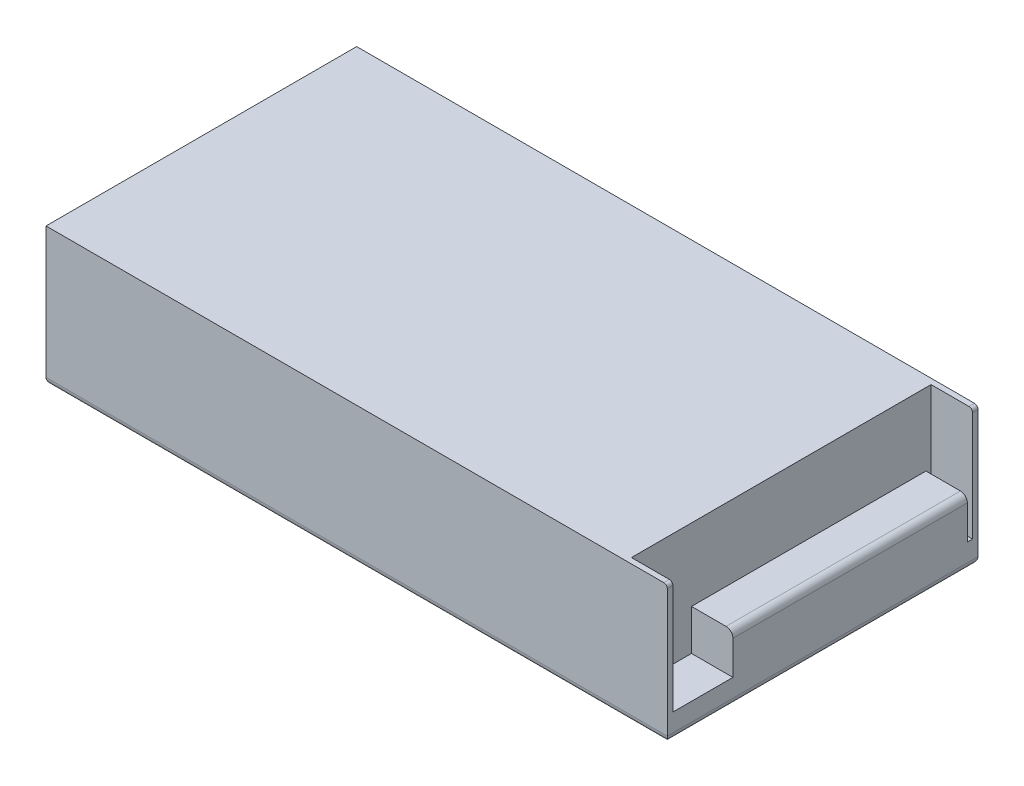
ISO-10303-21;
HEADER;
FILE_DESCRIPTION(('STEP AP214'),'2;1');
FILE_NAME('part.step','',(''),(''),'','','');
FILE_SCHEMA(('AUTOMOTIVE_DESIGN { 1 0 10303 214 1 1 1 1 }'));
ENDSEC;
DATA;
#1=APPLICATION_CONTEXT('core data for automotive mechanical design processes');
#2=APPLICATION_PROTOCOL_DEFINITION('international standard','automotive_design',2000,#1);
#3=PRODUCT_CONTEXT('',#1,'mechanical');
#4=PRODUCT('Part','Part','',(#3));
#5=PRODUCT_RELATED_PRODUCT_CATEGORY('part','',(#4));
#6=PRODUCT_DEFINITION_FORMATION('','',#4);
#7=PRODUCT_DEFINITION_CONTEXT('part definition',#1,'design');
#8=PRODUCT_DEFINITION('design','',#6,#7);
#9=PRODUCT_DEFINITION_SHAPE('','',#8);
#10=(LENGTH_UNIT() NAMED_UNIT(*) SI_UNIT(.MILLI.,.METRE.));
#11=(NAMED_UNIT(*) PLANE_ANGLE_UNIT() SI_UNIT($,.RADIAN.));
#12=(NAMED_UNIT(*) SI_UNIT($,.STERADIAN.) SOLID_ANGLE_UNIT());
#13=UNCERTAINTY_MEASURE_WITH_UNIT(LENGTH_MEASURE(1.E-05),#10,'distance_accuracy_value','');
#14=(GEOMETRIC_REPRESENTATION_CONTEXT(3) GLOBAL_UNCERTAINTY_ASSIGNED_CONTEXT((#13)) GLOBAL_UNIT_ASSIGNED_CONTEXT((#10,
#11,#12)) REPRESENTATION_CONTEXT('',''));
#15=CARTESIAN_POINT('',(0.,0.,0.));
#16=DIRECTION('',(0.,0.,1.));
#17=DIRECTION('',(1.,0.,0.));
#18=AXIS2_PLACEMENT_3D('',#15,#16,#17);
#19=CARTESIAN_POINT('',(159.130744158614,9.1948,-42.6802010082949));
#20=DIRECTION('',(-1.,0.,0.));
#21=DIRECTION('',(0.,0.,1.));
#22=AXIS2_PLACEMENT_3D('',#19,#20,#21);
#23=PLANE('',#22);
#24=DIRECTION('',(0.,-1.,0.));
#25=VECTOR('',#24,1.);
#26=CARTESIAN_POINT('',(159.130744158614,24.1808,-40.8006010082949));
#27=LINE('',#26,#25);
#28=CARTESIAN_POINT('',(159.130744158614,24.1808,-40.8006010082949));
#29=VERTEX_POINT('',#28);
#30=CARTESIAN_POINT('',(159.130744158614,9.1948,-40.8006010082949));
#31=VERTEX_POINT('',#30);
#32=EDGE_CURVE('E168',#29,#31,#27,.T.);
#33=ORIENTED_EDGE('',*,*,#32,.T.);
#34=DIRECTION('',(0.,0.,1.));
#35=VECTOR('',#34,1.);
#36=CARTESIAN_POINT('',(159.130744158614,9.1948,-42.6802010082949));
#37=LINE('',#36,#35);
#38=CARTESIAN_POINT('',(159.130744158614,9.1948,-42.6802010082949));
#39=VERTEX_POINT('',#38);
#40=EDGE_CURVE('E192',#39,#31,#37,.T.);
#41=ORIENTED_EDGE('',*,*,#40,.F.);
#42=DIRECTION('',(0.,1.,0.));
#43=VECTOR('',#42,1.);
#44=CARTESIAN_POINT('',(159.130744158614,9.1948,-42.6802010082949));
#45=LINE('',#44,#43);
#46=CARTESIAN_POINT('',(159.130744158614,50.8,-42.6802010082949));
#47=VERTEX_POINT('',#46);
#48=EDGE_CURVE('E212',#39,#47,#45,.T.);
#49=ORIENTED_EDGE('',*,*,#48,.T.);
#50=DIRECTION('',(0.,0.,1.));
#51=VECTOR('',#50,1.);
#52=CARTESIAN_POINT('',(159.130744158614,50.8,-42.6802010082949));
#53=LINE('',#52,#51);
#54=CARTESIAN_POINT('',(159.130744158614,50.8,67.5557989917051));
#55=VERTEX_POINT('',#54);
#56=EDGE_CURVE('E191',#47,#55,#53,.T.);
#57=ORIENTED_EDGE('',*,*,#56,.T.);
#58=DIRECTION('',(0.,1.,0.));
#59=VECTOR('',#58,1.);
#60=CARTESIAN_POINT('',(159.130744158614,9.1948,67.5557989917051));
#61=LINE('',#60,#59);
#62=CARTESIAN_POINT('',(159.130744158614,9.1948,67.5557989917051));
#63=VERTEX_POINT('',#62);
#64=EDGE_CURVE('E205',#63,#55,#61,.T.);
#65=ORIENTED_EDGE('',*,*,#64,.F.);
#66=CARTESIAN_POINT('',(159.130744158614,9.1948,45.4577989917051));
#67=VERTEX_POINT('',#66);
#68=EDGE_CURVE('E195',#67,#63,#37,.T.);
#69=ORIENTED_EDGE('',*,*,#68,.F.);
#70=DIRECTION('',(0.,-1.,0.));
#71=VECTOR('',#70,1.);
#72=CARTESIAN_POINT('',(159.130744158614,24.1808,45.4577989917051));
#73=LINE('',#72,#71);
#74=CARTESIAN_POINT('',(159.130744158614,24.1808,45.4577989917051));
#75=VERTEX_POINT('',#74);
#76=EDGE_CURVE('E176',#75,#67,#73,.T.);
#77=ORIENTED_EDGE('',*,*,#76,.F.);
#78=DIRECTION('',(0.,0.,1.));
#79=VECTOR('',#78,1.);
#80=CARTESIAN_POINT('',(159.130744158614,24.1808,45.4577989917051));
#81=LINE('',#80,#79);
#82=EDGE_CURVE('E160',#29,#75,#81,.T.);
#83=ORIENTED_EDGE('',*,*,#82,.F.);
#84=EDGE_LOOP('',(#33,#41,#49,#57,#65,#69,#77,#83));
#85=FACE_BOUND('',#84,.T.);
#86=ADVANCED_FACE('F33',(#85),#23,.F.);
#87=CARTESIAN_POINT('',(0.,9.1948,0.));
#88=DIRECTION('',(0.,1.,0.));
#89=DIRECTION('',(0.,0.,1.));
#90=AXIS2_PLACEMENT_3D('',#87,#88,#89);
#91=PLANE('',#90);
#92=ORIENTED_EDGE('',*,*,#40,.T.);
#93=DIRECTION('',(-1.,0.,0.));
#94=VECTOR('',#93,1.);
#95=CARTESIAN_POINT('',(174.370744158614,9.1948,-40.8006010082949));
#96=LINE('',#95,#94);
#97=CARTESIAN_POINT('',(174.370744158614,9.1948,-40.8006010082949));
#98=VERTEX_POINT('',#97);
#99=EDGE_CURVE('E171',#98,#31,#96,.T.);
#100=ORIENTED_EDGE('',*,*,#99,.F.);
#101=DIRECTION('',(0.,0.,-1.));
#102=VECTOR('',#101,1.);
#103=CARTESIAN_POINT('',(174.370744158614,9.1948,-42.6802010082949));
#104=LINE('',#103,#102);
#105=CARTESIAN_POINT('',(174.370744158614,9.1948,-42.6802010082949));
#106=VERTEX_POINT('',#105);
#107=EDGE_CURVE('E198',#98,#106,#104,.T.);
#108=ORIENTED_EDGE('',*,*,#107,.T.);
#109=DIRECTION('',(-1.,0.,0.));
#110=VECTOR('',#109,1.);
#111=CARTESIAN_POINT('',(159.130744158614,9.1948,-42.6802010082949));
#112=LINE('',#111,#110);
#113=EDGE_CURVE('E202',#106,#39,#112,.T.);
#114=ORIENTED_EDGE('',*,*,#113,.T.);
#115=EDGE_LOOP('',(#92,#100,#108,#114));
#116=FACE_BOUND('',#115,.T.);
#117=ADVANCED_FACE('F349',(#116),#91,.T.);
#118=CARTESIAN_POINT('',(174.370744158614,9.1948,67.5557989917051));
#119=VERTEX_POINT('',#118);
#120=CARTESIAN_POINT('',(174.370744158614,9.1948,45.4577989917051));
#121=VERTEX_POINT('',#120);
#122=EDGE_CURVE('E199',#119,#121,#104,.T.);
#123=ORIENTED_EDGE('',*,*,#122,.T.);
#124=DIRECTION('',(1.,0.,0.));
#125=VECTOR('',#124,1.);
#126=CARTESIAN_POINT('',(174.370744158614,9.1948,45.4577989917051));
#127=LINE('',#126,#125);
#128=EDGE_CURVE('E165',#67,#121,#127,.T.);
#129=ORIENTED_EDGE('',*,*,#128,.F.);
#130=ORIENTED_EDGE('',*,*,#68,.T.);
#131=DIRECTION('',(1.,0.,0.));
#132=VECTOR('',#131,1.);
#133=CARTESIAN_POINT('',(159.130744158614,9.1948,67.5557989917051));
#134=LINE('',#133,#132);
#135=EDGE_CURVE('E194',#63,#119,#134,.T.);
#136=ORIENTED_EDGE('',*,*,#135,.T.);
#137=EDGE_LOOP('',(#123,#129,#130,#136));
#138=FACE_BOUND('',#137,.T.);
#139=ADVANCED_FACE('F336',(#138),#91,.T.);
#140=CARTESIAN_POINT('',(-54.2292558413858,50.8,-44.7122010082949));
#141=DIRECTION('',(1.,0.,0.));
#142=DIRECTION('',(0.,0.,-1.));
#143=AXIS2_PLACEMENT_3D('',#140,#141,#142);
#144=PLANE('',#143);
#145=DIRECTION('',(0.,-1.,0.));
#146=VECTOR('',#145,1.);
#147=CARTESIAN_POINT('',(-54.2292558413858,50.8,-44.7122010082949));
#148=LINE('',#147,#146);
#149=CARTESIAN_POINT('',(-54.2292558413858,50.8,-44.7122010082949));
#150=VERTEX_POINT('',#149);
#151=CARTESIAN_POINT('',(-54.2292558413858,2.54,-44.7122010082949));
#152=VERTEX_POINT('',#151);
#153=EDGE_CURVE('E231',#150,#152,#148,.T.);
#154=ORIENTED_EDGE('',*,*,#153,.T.);
#155=DIRECTION('',(0.,0.,1.));
#156=VECTOR('',#155,1.);
#157=CARTESIAN_POINT('',(-54.2292558413858,2.54,-44.7122010082949));
#158=LINE('',#157,#156);
#159=CARTESIAN_POINT('',(-54.2292558413858,2.54,69.5877989917051));
#160=VERTEX_POINT('',#159);
#161=EDGE_CURVE('E265',#152,#160,#158,.T.);
#162=ORIENTED_EDGE('',*,*,#161,.T.);
#163=DIRECTION('',(0.,-1.,0.));
#164=VECTOR('',#163,1.);
#165=CARTESIAN_POINT('',(-54.2292558413858,50.8,69.5877989917051));
#166=LINE('',#165,#164);
#167=CARTESIAN_POINT('',(-54.2292558413858,50.8,69.5877989917051));
#168=VERTEX_POINT('',#167);
#169=EDGE_CURVE('E238',#168,#160,#166,.T.);
#170=ORIENTED_EDGE('',*,*,#169,.F.);
#171=DIRECTION('',(0.,0.,1.));
#172=VECTOR('',#171,1.);
#173=CARTESIAN_POINT('',(-54.2292558413858,50.8,-44.7122010082949));
#174=LINE('',#173,#172);
#175=EDGE_CURVE('E215',#150,#168,#174,.T.);
#176=ORIENTED_EDGE('',*,*,#175,.F.);
#177=EDGE_LOOP('',(#154,#162,#170,#176));
#178=FACE_BOUND('',#177,.T.);
#179=ADVANCED_FACE('F306',(#178),#144,.F.);
#180=CARTESIAN_POINT('',(-54.2292558413858,50.8,69.5877989917051));
#181=DIRECTION('',(0.,0.,-1.));
#182=DIRECTION('',(-1.,0.,0.));
#183=AXIS2_PLACEMENT_3D('',#180,#181,#182);
#184=PLANE('',#183);
#185=ORIENTED_EDGE('',*,*,#169,.T.);
#186=DIRECTION('',(1.,0.,0.));
#187=VECTOR('',#186,1.);
#188=CARTESIAN_POINT('',(-54.2292558413858,2.54,69.5877989917051));
#189=LINE('',#188,#187);
#190=CARTESIAN_POINT('',(174.370744158614,2.54,69.5877989917051));
#191=VERTEX_POINT('',#190);
#192=EDGE_CURVE('E11',#160,#191,#189,.T.);
#193=ORIENTED_EDGE('',*,*,#192,.T.);
#194=DIRECTION('',(0.,-1.,0.));
#195=VECTOR('',#194,1.);
#196=CARTESIAN_POINT('',(174.370744158614,50.8,69.5877989917051));
#197=LINE('',#196,#195);
#198=CARTESIAN_POINT('',(174.370744158614,49.53,69.5877989917051));
#199=VERTEX_POINT('',#198);
#200=EDGE_CURVE('E236',#199,#191,#197,.T.);
#201=ORIENTED_EDGE('',*,*,#200,.F.);
#202=CARTESIAN_POINT('',(173.100744158614,49.53,69.5877989917051));
#203=DIRECTION('',(0.,0.,-1.));
#204=DIRECTION('',(-1.,0.,0.));
#205=AXIS2_PLACEMENT_3D('',#202,#203,#204);
#206=CIRCLE('',#205,1.27);
#207=CARTESIAN_POINT('',(173.100744158614,50.8,69.5877989917051));
#208=VERTEX_POINT('',#207);
#209=EDGE_CURVE('E263',#199,#208,#206,.F.);
#210=ORIENTED_EDGE('',*,*,#209,.T.);
#211=DIRECTION('',(1.,0.,0.));
#212=VECTOR('',#211,1.);
#213=CARTESIAN_POINT('',(-54.2292558413858,50.8,69.5877989917051));
#214=LINE('',#213,#212);
#215=EDGE_CURVE('E226',#168,#208,#214,.T.);
#216=ORIENTED_EDGE('',*,*,#215,.F.);
#217=EDGE_LOOP('',(#185,#193,#201,#210,#216));
#218=FACE_BOUND('',#217,.T.);
#219=ADVANCED_FACE('F309',(#218),#184,.F.);
#220=CARTESIAN_POINT('',(174.370744158614,50.8,-44.7122010082949));
#221=DIRECTION('',(-1.,0.,0.));
#222=DIRECTION('',(0.,0.,1.));
#223=AXIS2_PLACEMENT_3D('',#220,#221,#222);
#224=PLANE('',#223);
#225=ORIENTED_EDGE('',*,*,#200,.T.);
#226=DIRECTION('',(0.,0.,-1.));
#227=VECTOR('',#226,1.);
#228=CARTESIAN_POINT('',(174.370744158614,2.54,-44.7122010082949));
#229=LINE('',#228,#227);
#230=CARTESIAN_POINT('',(174.370744158614,2.54,-44.7122010082949));
#231=VERTEX_POINT('',#230);
#232=EDGE_CURVE('E55',#191,#231,#229,.T.);
#233=ORIENTED_EDGE('',*,*,#232,.T.);
#234=DIRECTION('',(0.,-1.,0.));
#235=VECTOR('',#234,1.);
#236=CARTESIAN_POINT('',(174.370744158614,50.8,-44.7122010082949));
#237=LINE('',#236,#235);
#238=CARTESIAN_POINT('',(174.370744158614,49.53,-44.7122010082949));
#239=VERTEX_POINT('',#238);
#240=EDGE_CURVE('E234',#239,#231,#237,.T.);
#241=ORIENTED_EDGE('',*,*,#240,.F.);
#242=DIRECTION('',(0.,0.,-1.));
#243=VECTOR('',#242,1.);
#244=CARTESIAN_POINT('',(174.370744158614,49.53,-42.6802010082949));
#245=LINE('',#244,#243);
#246=CARTESIAN_POINT('',(174.370744158614,49.53,-42.6802010082949));
#247=VERTEX_POINT('',#246);
#248=EDGE_CURVE('E257',#239,#247,#245,.F.);
#249=ORIENTED_EDGE('',*,*,#248,.T.);
#250=DIRECTION('',(0.,1.,0.));
#251=VECTOR('',#250,1.);
#252=CARTESIAN_POINT('',(174.370744158614,9.1948,-42.6802010082949));
#253=LINE('',#252,#251);
#254=EDGE_CURVE('E216',#106,#247,#253,.T.);
#255=ORIENTED_EDGE('',*,*,#254,.F.);
#256=ORIENTED_EDGE('',*,*,#107,.F.);
#257=DIRECTION('',(0.,-1.,0.));
#258=VECTOR('',#257,1.);
#259=CARTESIAN_POINT('',(174.370744158614,24.1808,-40.8006010082949));
#260=LINE('',#259,#258);
#261=CARTESIAN_POINT('',(174.370744158614,21.6408,-40.8006010082949));
#262=VERTEX_POINT('',#261);
#263=EDGE_CURVE('E175',#262,#98,#260,.T.);
#264=ORIENTED_EDGE('',*,*,#263,.F.);
#265=DIRECTION('',(0.,0.,-1.));
#266=VECTOR('',#265,1.);
#267=CARTESIAN_POINT('',(174.370744158614,21.6408,45.4577989917051));
#268=LINE('',#267,#266);
#269=CARTESIAN_POINT('',(174.370744158614,21.6408,45.4577989917051));
#270=VERTEX_POINT('',#269);
#271=EDGE_CURVE('E243',#262,#270,#268,.F.);
#272=ORIENTED_EDGE('',*,*,#271,.T.);
#273=DIRECTION('',(0.,-1.,0.));
#274=VECTOR('',#273,1.);
#275=CARTESIAN_POINT('',(174.370744158614,24.1808,45.4577989917051));
#276=LINE('',#275,#274);
#277=EDGE_CURVE('E182',#270,#121,#276,.T.);
#278=ORIENTED_EDGE('',*,*,#277,.T.);
#279=ORIENTED_EDGE('',*,*,#122,.F.);
#280=DIRECTION('',(0.,1.,0.));
#281=VECTOR('',#280,1.);
#282=CARTESIAN_POINT('',(174.370744158614,9.1948,67.5557989917051));
#283=LINE('',#282,#281);
#284=CARTESIAN_POINT('',(174.370744158614,49.53,67.5557989917051));
#285=VERTEX_POINT('',#284);
#286=EDGE_CURVE('E219',#119,#285,#283,.T.);
#287=ORIENTED_EDGE('',*,*,#286,.T.);
#288=DIRECTION('',(0.,0.,-1.));
#289=VECTOR('',#288,1.);
#290=CARTESIAN_POINT('',(174.370744158614,49.53,69.5877989917051));
#291=LINE('',#290,#289);
#292=EDGE_CURVE('E255',#285,#199,#291,.F.);
#293=ORIENTED_EDGE('',*,*,#292,.T.);
#294=EDGE_LOOP('',(#225,#233,#241,#249,#255,#256,#264,#272,#278,#279,#287,#293));
#295=FACE_BOUND('',#294,.T.);
#296=ADVANCED_FACE('F320',(#295),#224,.F.);
#297=CARTESIAN_POINT('',(-54.2292558413858,50.8,-44.7122010082949));
#298=DIRECTION('',(0.,0.,1.));
#299=DIRECTION('',(1.,0.,0.));
#300=AXIS2_PLACEMENT_3D('',#297,#298,#299);
#301=PLANE('',#300);
#302=ORIENTED_EDGE('',*,*,#240,.T.);
#303=DIRECTION('',(-1.,0.,0.));
#304=VECTOR('',#303,1.);
#305=CARTESIAN_POINT('',(-54.2292558413858,2.54,-44.7122010082949));
#306=LINE('',#305,#304);
#307=EDGE_CURVE('E42',#231,#152,#306,.T.);
#308=ORIENTED_EDGE('',*,*,#307,.T.);
#309=ORIENTED_EDGE('',*,*,#153,.F.);
#310=DIRECTION('',(-1.,0.,0.));
#311=VECTOR('',#310,1.);
#312=CARTESIAN_POINT('',(-54.2292558413858,50.8,-44.7122010082949));
#313=LINE('',#312,#311);
#314=CARTESIAN_POINT('',(173.100744158614,50.8,-44.7122010082949));
#315=VERTEX_POINT('',#314);
#316=EDGE_CURVE('E229',#315,#150,#313,.T.);
#317=ORIENTED_EDGE('',*,*,#316,.F.);
#318=CARTESIAN_POINT('',(173.100744158614,49.53,-44.7122010082949));
#319=DIRECTION('',(0.,0.,1.));
#320=DIRECTION('',(1.,0.,0.));
#321=AXIS2_PLACEMENT_3D('',#318,#319,#320);
#322=CIRCLE('',#321,1.27);
#323=EDGE_CURVE('E253',#315,#239,#322,.F.);
#324=ORIENTED_EDGE('',*,*,#323,.T.);
#325=EDGE_LOOP('',(#302,#308,#309,#317,#324));
#326=FACE_BOUND('',#325,.T.);
#327=ADVANCED_FACE('F318',(#326),#301,.F.);
#328=CARTESIAN_POINT('',(0.,50.8,0.));
#329=DIRECTION('',(0.,1.,0.));
#330=DIRECTION('',(0.,0.,1.));
#331=AXIS2_PLACEMENT_3D('',#328,#329,#330);
#332=PLANE('',#331);
#333=DIRECTION('',(-1.,0.,0.));
#334=VECTOR('',#333,1.);
#335=CARTESIAN_POINT('',(159.130744158614,50.8,-42.6802010082949));
#336=LINE('',#335,#334);
#337=CARTESIAN_POINT('',(173.100744158614,50.8,-42.6802010082949));
#338=VERTEX_POINT('',#337);
#339=EDGE_CURVE('E210',#338,#47,#336,.T.);
#340=ORIENTED_EDGE('',*,*,#339,.F.);
#341=DIRECTION('',(0.,0.,-1.));
#342=VECTOR('',#341,1.);
#343=CARTESIAN_POINT('',(173.100744158614,50.8,-44.7122010082949));
#344=LINE('',#343,#342);
#345=EDGE_CURVE('E250',#338,#315,#344,.T.);
#346=ORIENTED_EDGE('',*,*,#345,.T.);
#347=ORIENTED_EDGE('',*,*,#316,.T.);
#348=ORIENTED_EDGE('',*,*,#175,.T.);
#349=ORIENTED_EDGE('',*,*,#215,.T.);
#350=DIRECTION('',(0.,0.,-1.));
#351=VECTOR('',#350,1.);
#352=CARTESIAN_POINT('',(173.100744158614,50.8,67.5557989917051));
#353=LINE('',#352,#351);
#354=CARTESIAN_POINT('',(173.100744158614,50.8,67.5557989917051));
#355=VERTEX_POINT('',#354);
#356=EDGE_CURVE('E247',#208,#355,#353,.T.);
#357=ORIENTED_EDGE('',*,*,#356,.T.);
#358=DIRECTION('',(1.,0.,0.));
#359=VECTOR('',#358,1.);
#360=CARTESIAN_POINT('',(159.130744158614,50.8,67.5557989917051));
#361=LINE('',#360,#359);
#362=EDGE_CURVE('E207',#55,#355,#361,.T.);
#363=ORIENTED_EDGE('',*,*,#362,.F.);
#364=ORIENTED_EDGE('',*,*,#56,.F.);
#365=EDGE_LOOP('',(#340,#346,#347,#348,#349,#357,#363,#364));
#366=FACE_BOUND('',#365,.T.);
#367=ADVANCED_FACE('F314',(#366),#332,.T.);
#368=CARTESIAN_POINT('',(0.,0.,0.));
#369=DIRECTION('',(0.,1.,0.));
#370=DIRECTION('',(0.,0.,1.));
#371=AXIS2_PLACEMENT_3D('',#368,#369,#370);
#372=PLANE('',#371);
#373=DIRECTION('',(0.,0.,1.));
#374=VECTOR('',#373,1.);
#375=CARTESIAN_POINT('',(-51.6892558413858,0.,0.));
#376=LINE('',#375,#374);
#377=CARTESIAN_POINT('',(-51.6892558413858,0.,67.0477989917051));
#378=VERTEX_POINT('',#377);
#379=CARTESIAN_POINT('',(-51.6892558413858,0.,-42.1722010082949));
#380=VERTEX_POINT('',#379);
#381=EDGE_CURVE('E272',#378,#380,#376,.F.);
#382=ORIENTED_EDGE('',*,*,#381,.T.);
#383=DIRECTION('',(-1.,0.,0.));
#384=VECTOR('',#383,1.);
#385=CARTESIAN_POINT('',(0.,0.,-42.1722010082949));
#386=LINE('',#385,#384);
#387=CARTESIAN_POINT('',(171.830744158614,0.,-42.1722010082949));
#388=VERTEX_POINT('',#387);
#389=EDGE_CURVE('E275',#380,#388,#386,.F.);
#390=ORIENTED_EDGE('',*,*,#389,.T.);
#391=DIRECTION('',(0.,0.,-1.));
#392=VECTOR('',#391,1.);
#393=CARTESIAN_POINT('',(171.830744158614,0.,0.));
#394=LINE('',#393,#392);
#395=CARTESIAN_POINT('',(171.830744158614,0.,67.0477989917051));
#396=VERTEX_POINT('',#395);
#397=EDGE_CURVE('E270',#388,#396,#394,.F.);
#398=ORIENTED_EDGE('',*,*,#397,.T.);
#399=DIRECTION('',(1.,0.,0.));
#400=VECTOR('',#399,1.);
#401=CARTESIAN_POINT('',(0.,0.,67.0477989917051));
#402=LINE('',#401,#400);
#403=EDGE_CURVE('E268',#396,#378,#402,.F.);
#404=ORIENTED_EDGE('',*,*,#403,.T.);
#405=EDGE_LOOP('',(#382,#390,#398,#404));
#406=FACE_BOUND('',#405,.T.);
#407=ADVANCED_FACE('F297',(#406),#372,.F.);
#408=CARTESIAN_POINT('',(159.130744158614,9.1948,-42.6802010082949));
#409=DIRECTION('',(0.,0.,-1.));
#410=DIRECTION('',(-1.,0.,0.));
#411=AXIS2_PLACEMENT_3D('',#408,#409,#410);
#412=PLANE('',#411);
#413=ORIENTED_EDGE('',*,*,#254,.T.);
#414=CARTESIAN_POINT('',(173.100744158614,49.53,-42.6802010082949));
#415=DIRECTION('',(0.,0.,-1.));
#416=DIRECTION('',(-1.,0.,0.));
#417=AXIS2_PLACEMENT_3D('',#414,#415,#416);
#418=CIRCLE('',#417,1.27);
#419=EDGE_CURVE('E259',#247,#338,#418,.F.);
#420=ORIENTED_EDGE('',*,*,#419,.T.);
#421=ORIENTED_EDGE('',*,*,#339,.T.);
#422=ORIENTED_EDGE('',*,*,#48,.F.);
#423=ORIENTED_EDGE('',*,*,#113,.F.);
#424=EDGE_LOOP('',(#413,#420,#421,#422,#423));
#425=FACE_BOUND('',#424,.T.);
#426=ADVANCED_FACE('F326',(#425),#412,.F.);
#427=CARTESIAN_POINT('',(159.130744158614,9.1948,67.5557989917051));
#428=DIRECTION('',(0.,0.,1.));
#429=DIRECTION('',(1.,0.,0.));
#430=AXIS2_PLACEMENT_3D('',#427,#428,#429);
#431=PLANE('',#430);
#432=ORIENTED_EDGE('',*,*,#362,.T.);
#433=CARTESIAN_POINT('',(173.100744158614,49.53,67.5557989917051));
#434=DIRECTION('',(0.,0.,1.));
#435=DIRECTION('',(1.,0.,0.));
#436=AXIS2_PLACEMENT_3D('',#433,#434,#435);
#437=CIRCLE('',#436,1.27);
#438=EDGE_CURVE('E261',#355,#285,#437,.F.);
#439=ORIENTED_EDGE('',*,*,#438,.T.);
#440=ORIENTED_EDGE('',*,*,#286,.F.);
#441=ORIENTED_EDGE('',*,*,#135,.F.);
#442=ORIENTED_EDGE('',*,*,#64,.T.);
#443=EDGE_LOOP('',(#432,#439,#440,#441,#442));
#444=FACE_BOUND('',#443,.T.);
#445=ADVANCED_FACE('F333',(#444),#431,.F.);
#446=CARTESIAN_POINT('',(174.370744158614,24.1808,-40.8006010082949));
#447=DIRECTION('',(0.,0.,1.));
#448=DIRECTION('',(1.,0.,0.));
#449=AXIS2_PLACEMENT_3D('',#446,#447,#448);
#450=PLANE('',#449);
#451=DIRECTION('',(-1.,0.,0.));
#452=VECTOR('',#451,1.);
#453=CARTESIAN_POINT('',(174.370744158614,24.1808,-40.8006010082949));
#454=LINE('',#453,#452);
#455=CARTESIAN_POINT('',(171.830744158614,24.1808,-40.8006010082949));
#456=VERTEX_POINT('',#455);
#457=EDGE_CURVE('E155',#456,#29,#454,.T.);
#458=ORIENTED_EDGE('',*,*,#457,.F.);
#459=CARTESIAN_POINT('',(171.830744158614,21.6408,-40.8006010082949));
#460=DIRECTION('',(0.,0.,1.));
#461=DIRECTION('',(1.,0.,0.));
#462=AXIS2_PLACEMENT_3D('',#459,#460,#461);
#463=CIRCLE('',#462,2.54);
#464=EDGE_CURVE('E241',#456,#262,#463,.F.);
#465=ORIENTED_EDGE('',*,*,#464,.T.);
#466=ORIENTED_EDGE('',*,*,#263,.T.);
#467=ORIENTED_EDGE('',*,*,#99,.T.);
#468=ORIENTED_EDGE('',*,*,#32,.F.);
#469=EDGE_LOOP('',(#458,#465,#466,#467,#468));
#470=FACE_BOUND('',#469,.T.);
#471=ADVANCED_FACE('F169',(#470),#450,.F.);
#472=CARTESIAN_POINT('',(174.370744158614,24.1808,45.4577989917051));
#473=DIRECTION('',(0.,0.,-1.));
#474=DIRECTION('',(-1.,0.,0.));
#475=AXIS2_PLACEMENT_3D('',#472,#473,#474);
#476=PLANE('',#475);
#477=ORIENTED_EDGE('',*,*,#277,.F.);
#478=CARTESIAN_POINT('',(171.830744158614,21.6408,45.4577989917051));
#479=DIRECTION('',(0.,0.,-1.));
#480=DIRECTION('',(-1.,0.,0.));
#481=AXIS2_PLACEMENT_3D('',#478,#479,#480);
#482=CIRCLE('',#481,2.54);
#483=CARTESIAN_POINT('',(171.830744158614,24.1808,45.4577989917051));
#484=VERTEX_POINT('',#483);
#485=EDGE_CURVE('E245',#270,#484,#482,.F.);
#486=ORIENTED_EDGE('',*,*,#485,.T.);
#487=DIRECTION('',(1.,0.,0.));
#488=VECTOR('',#487,1.);
#489=CARTESIAN_POINT('',(174.370744158614,24.1808,45.4577989917051));
#490=LINE('',#489,#488);
#491=EDGE_CURVE('E180',#75,#484,#490,.T.);
#492=ORIENTED_EDGE('',*,*,#491,.F.);
#493=ORIENTED_EDGE('',*,*,#76,.T.);
#494=ORIENTED_EDGE('',*,*,#128,.T.);
#495=EDGE_LOOP('',(#477,#486,#492,#493,#494));
#496=FACE_BOUND('',#495,.T.);
#497=ADVANCED_FACE('F344',(#496),#476,.F.);
#498=CARTESIAN_POINT('',(0.,24.1808,0.));
#499=DIRECTION('',(0.,1.,0.));
#500=DIRECTION('',(0.,0.,1.));
#501=AXIS2_PLACEMENT_3D('',#498,#499,#500);
#502=PLANE('',#501);
#503=ORIENTED_EDGE('',*,*,#491,.T.);
#504=DIRECTION('',(0.,0.,-1.));
#505=VECTOR('',#504,1.);
#506=CARTESIAN_POINT('',(171.830744158614,24.1808,-40.8006010082949));
#507=LINE('',#506,#505);
#508=EDGE_CURVE('E163',#484,#456,#507,.T.);
#509=ORIENTED_EDGE('',*,*,#508,.T.);
#510=ORIENTED_EDGE('',*,*,#457,.T.);
#511=ORIENTED_EDGE('',*,*,#82,.T.);
#512=EDGE_LOOP('',(#503,#509,#510,#511));
#513=FACE_BOUND('',#512,.T.);
#514=ADVANCED_FACE('F158',(#513),#502,.T.);
#515=CARTESIAN_POINT('',(171.830744158614,21.6408,0.));
#516=DIRECTION('',(0.,0.,1.));
#517=DIRECTION('',(1.,0.,0.));
#518=AXIS2_PLACEMENT_3D('',#515,#516,#517);
#519=CYLINDRICAL_SURFACE('',#518,2.54);
#520=ORIENTED_EDGE('',*,*,#485,.F.);
#521=ORIENTED_EDGE('',*,*,#271,.F.);
#522=ORIENTED_EDGE('',*,*,#464,.F.);
#523=ORIENTED_EDGE('',*,*,#508,.F.);
#524=EDGE_LOOP('',(#520,#521,#522,#523));
#525=FACE_BOUND('',#524,.T.);
#526=ADVANCED_FACE('F346',(#525),#519,.T.);
#527=CARTESIAN_POINT('',(173.100744158614,49.53,0.));
#528=DIRECTION('',(0.,0.,1.));
#529=DIRECTION('',(1.,0.,0.));
#530=AXIS2_PLACEMENT_3D('',#527,#528,#529);
#531=CYLINDRICAL_SURFACE('',#530,1.27);
#532=ORIENTED_EDGE('',*,*,#419,.F.);
#533=ORIENTED_EDGE('',*,*,#248,.F.);
#534=ORIENTED_EDGE('',*,*,#323,.F.);
#535=ORIENTED_EDGE('',*,*,#345,.F.);
#536=EDGE_LOOP('',(#532,#533,#534,#535));
#537=FACE_BOUND('',#536,.T.);
#538=ADVANCED_FACE('F324',(#537),#531,.T.);
#539=CARTESIAN_POINT('',(173.100744158614,49.53,0.));
#540=DIRECTION('',(0.,0.,1.));
#541=DIRECTION('',(1.,0.,0.));
#542=AXIS2_PLACEMENT_3D('',#539,#540,#541);
#543=CYLINDRICAL_SURFACE('',#542,1.27);
#544=ORIENTED_EDGE('',*,*,#209,.F.);
#545=ORIENTED_EDGE('',*,*,#292,.F.);
#546=ORIENTED_EDGE('',*,*,#438,.F.);
#547=ORIENTED_EDGE('',*,*,#356,.F.);
#548=EDGE_LOOP('',(#544,#545,#546,#547));
#549=FACE_BOUND('',#548,.T.);
#550=ADVANCED_FACE('F380',(#549),#543,.T.);
#551=CARTESIAN_POINT('',(171.830744158614,2.54,-44.7122010082949));
#552=DIRECTION('',(0.,0.,-1.));
#553=DIRECTION('',(-1.,0.,0.));
#554=AXIS2_PLACEMENT_3D('',#551,#552,#553);
#555=CYLINDRICAL_SURFACE('',#554,2.54);
#556=CARTESIAN_POINT('',(171.830744158614,2.54,67.0477989917051));
#557=DIRECTION('',(0.707106781186547,0.,-0.707106781186548));
#558=DIRECTION('',(0.707106781186548,0.,0.707106781186547));
#559=AXIS2_PLACEMENT_3D('',#556,#557,#558);
#560=ELLIPSE('',#559,3.59210244842766,2.54);
#561=EDGE_CURVE('E282',#396,#191,#560,.F.);
#562=ORIENTED_EDGE('',*,*,#561,.F.);
#563=ORIENTED_EDGE('',*,*,#397,.F.);
#564=CARTESIAN_POINT('',(171.830744158614,2.54,-42.1722010082949));
#565=DIRECTION('',(-0.707106781186548,0.,-0.707106781186547));
#566=DIRECTION('',(-0.707106781186547,0.,0.707106781186548));
#567=AXIS2_PLACEMENT_3D('',#564,#565,#566);
#568=ELLIPSE('',#567,3.59210244842766,2.54);
#569=EDGE_CURVE('E37',#231,#388,#568,.T.);
#570=ORIENTED_EDGE('',*,*,#569,.F.);
#571=ORIENTED_EDGE('',*,*,#232,.F.);
#572=EDGE_LOOP('',(#562,#563,#570,#571));
#573=FACE_BOUND('',#572,.T.);
#574=ADVANCED_FACE('F35',(#573),#555,.T.);
#575=CARTESIAN_POINT('',(-54.2292558413858,2.54,-42.1722010082949));
#576=DIRECTION('',(-1.,0.,0.));
#577=DIRECTION('',(0.,0.,1.));
#578=AXIS2_PLACEMENT_3D('',#575,#576,#577);
#579=CYLINDRICAL_SURFACE('',#578,2.54);
#580=ORIENTED_EDGE('',*,*,#569,.T.);
#581=ORIENTED_EDGE('',*,*,#389,.F.);
#582=CARTESIAN_POINT('',(-51.6892558413858,2.54,-42.1722010082949));
#583=DIRECTION('',(-0.707106781186547,0.,0.707106781186548));
#584=DIRECTION('',(-0.707106781186548,0.,-0.707106781186547));
#585=AXIS2_PLACEMENT_3D('',#582,#583,#584);
#586=ELLIPSE('',#585,3.59210244842766,2.54);
#587=EDGE_CURVE('E281',#152,#380,#586,.T.);
#588=ORIENTED_EDGE('',*,*,#587,.F.);
#589=ORIENTED_EDGE('',*,*,#307,.F.);
#590=EDGE_LOOP('',(#580,#581,#588,#589));
#591=FACE_BOUND('',#590,.T.);
#592=ADVANCED_FACE('F292',(#591),#579,.T.);
#593=CARTESIAN_POINT('',(-54.2292558413858,2.54,67.0477989917051));
#594=DIRECTION('',(1.,0.,0.));
#595=DIRECTION('',(0.,0.,-1.));
#596=AXIS2_PLACEMENT_3D('',#593,#594,#595);
#597=CYLINDRICAL_SURFACE('',#596,2.54);
#598=ORIENTED_EDGE('',*,*,#561,.T.);
#599=ORIENTED_EDGE('',*,*,#192,.F.);
#600=CARTESIAN_POINT('',(-51.6892558413858,2.54,67.0477989917051));
#601=DIRECTION('',(0.707106781186548,0.,0.707106781186547));
#602=DIRECTION('',(0.707106781186547,0.,-0.707106781186548));
#603=AXIS2_PLACEMENT_3D('',#600,#601,#602);
#604=ELLIPSE('',#603,3.59210244842766,2.54);
#605=EDGE_CURVE('E279',#378,#160,#604,.F.);
#606=ORIENTED_EDGE('',*,*,#605,.F.);
#607=ORIENTED_EDGE('',*,*,#403,.F.);
#608=EDGE_LOOP('',(#598,#599,#606,#607));
#609=FACE_BOUND('',#608,.T.);
#610=ADVANCED_FACE('F303',(#609),#597,.T.);
#611=CARTESIAN_POINT('',(-51.6892558413858,2.54,-44.7122010082949));
#612=DIRECTION('',(0.,0.,1.));
#613=DIRECTION('',(1.,0.,0.));
#614=AXIS2_PLACEMENT_3D('',#611,#612,#613);
#615=CYLINDRICAL_SURFACE('',#614,2.54);
#616=ORIENTED_EDGE('',*,*,#587,.T.);
#617=ORIENTED_EDGE('',*,*,#381,.F.);
#618=ORIENTED_EDGE('',*,*,#605,.T.);
#619=ORIENTED_EDGE('',*,*,#161,.F.);
#620=EDGE_LOOP('',(#616,#617,#618,#619));
#621=FACE_BOUND('',#620,.T.);
#622=ADVANCED_FACE('F301',(#621),#615,.T.);
#623=CLOSED_SHELL('',(#86,#117,#139,#179,#219,#296,#327,#367,#407,#426,#445,#471,#497,#514,#526,
#538,#550,#574,#592,#610,#622));
#624=MANIFOLD_SOLID_BREP('B2',#623);
#625=ADVANCED_BREP_SHAPE_REPRESENTATION('',(#18,#624),#14);
#626=SHAPE_DEFINITION_REPRESENTATION(#9,#625);
ENDSEC;
END-ISO-10303-21;
